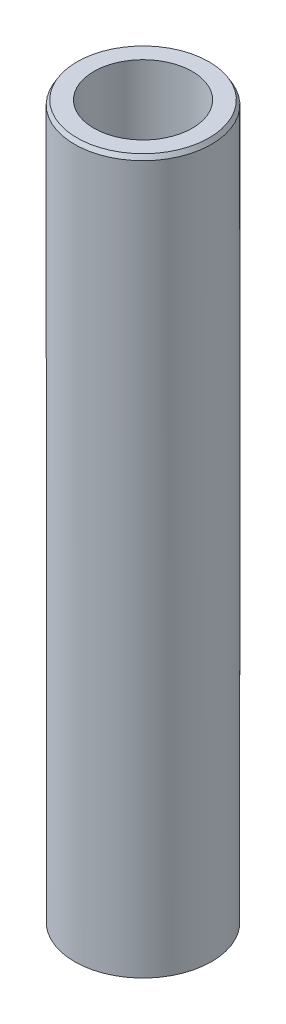
ISO-10303-21;
HEADER;
FILE_DESCRIPTION(('STEP AP214'),'2;1');
FILE_NAME('part.step','',(''),(''),'','','');
FILE_SCHEMA(('AUTOMOTIVE_DESIGN { 1 0 10303 214 1 1 1 1 }'));
ENDSEC;
DATA;
#1=APPLICATION_CONTEXT('core data for automotive mechanical design processes');
#2=APPLICATION_PROTOCOL_DEFINITION('international standard','automotive_design',2000,#1);
#3=PRODUCT_CONTEXT('',#1,'mechanical');
#4=PRODUCT('Part','Part','',(#3));
#5=PRODUCT_RELATED_PRODUCT_CATEGORY('part','',(#4));
#6=PRODUCT_DEFINITION_FORMATION('','',#4);
#7=PRODUCT_DEFINITION_CONTEXT('part definition',#1,'design');
#8=PRODUCT_DEFINITION('design','',#6,#7);
#9=PRODUCT_DEFINITION_SHAPE('','',#8);
#10=(LENGTH_UNIT() NAMED_UNIT(*) SI_UNIT(.MILLI.,.METRE.));
#11=(NAMED_UNIT(*) PLANE_ANGLE_UNIT() SI_UNIT($,.RADIAN.));
#12=(NAMED_UNIT(*) SI_UNIT($,.STERADIAN.) SOLID_ANGLE_UNIT());
#13=UNCERTAINTY_MEASURE_WITH_UNIT(LENGTH_MEASURE(1.E-05),#10,'distance_accuracy_value','');
#14=(GEOMETRIC_REPRESENTATION_CONTEXT(3) GLOBAL_UNCERTAINTY_ASSIGNED_CONTEXT((#13)) GLOBAL_UNIT_ASSIGNED_CONTEXT((#10,
#11,#12)) REPRESENTATION_CONTEXT('',''));
#15=CARTESIAN_POINT('',(0.,0.,0.));
#16=DIRECTION('',(0.,0.,1.));
#17=DIRECTION('',(1.,0.,0.));
#18=AXIS2_PLACEMENT_3D('',#15,#16,#17);
#19=CARTESIAN_POINT('',(0.,600.,0.));
#20=DIRECTION('',(0.,-1.,0.));
#21=DIRECTION('',(0.,0.,-1.));
#22=AXIS2_PLACEMENT_3D('',#19,#20,#21);
#23=CYLINDRICAL_SURFACE('',#22,57.5);
#24=CARTESIAN_POINT('',(0.,596.375143427795,0.));
#25=DIRECTION('',(0.,1.,0.));
#26=DIRECTION('',(0.,0.,1.));
#27=AXIS2_PLACEMENT_3D('',#24,#25,#26);
#28=CIRCLE('',#27,57.5);
#29=CARTESIAN_POINT('',(0.,596.375143427795,-57.5));
#30=VERTEX_POINT('',#29);
#31=EDGE_CURVE('E50',#30,#30,#28,.F.);
#32=ORIENTED_EDGE('',*,*,#31,.T.);
#33=EDGE_LOOP('',(#32));
#34=FACE_BOUND('',#33,.T.);
#35=CARTESIAN_POINT('',(0.,2.09281191773592,0.));
#36=DIRECTION('',(0.,1.,0.));
#37=DIRECTION('',(0.,0.,1.));
#38=AXIS2_PLACEMENT_3D('',#35,#36,#37);
#39=CIRCLE('',#38,57.5);
#40=CARTESIAN_POINT('',(0.,2.09281191773592,57.5));
#41=VERTEX_POINT('',#40);
#42=EDGE_CURVE('E51',#41,#41,#39,.T.);
#43=ORIENTED_EDGE('',*,*,#42,.T.);
#44=EDGE_LOOP('',(#43));
#45=FACE_BOUND('',#44,.T.);
#46=ADVANCED_FACE('F39',(#34,#45),#23,.T.);
#47=CARTESIAN_POINT('',(0.,600.,0.));
#48=DIRECTION('',(0.,1.,0.));
#49=DIRECTION('',(0.,0.,1.));
#50=AXIS2_PLACEMENT_3D('',#47,#48,#49);
#51=PLANE('',#50);
#52=CARTESIAN_POINT('',(0.,600.,0.));
#53=DIRECTION('',(0.,1.,0.));
#54=DIRECTION('',(0.,0.,1.));
#55=AXIS2_PLACEMENT_3D('',#52,#53,#54);
#56=CIRCLE('',#55,55.4071880822639);
#57=CARTESIAN_POINT('',(0.,600.,-55.4071880822639));
#58=VERTEX_POINT('',#57);
#59=EDGE_CURVE('E54',#58,#58,#56,.T.);
#60=ORIENTED_EDGE('',*,*,#59,.T.);
#61=EDGE_LOOP('',(#60));
#62=FACE_BOUND('',#61,.T.);
#63=CARTESIAN_POINT('',(0.,600.,0.));
#64=DIRECTION('',(0.,1.,0.));
#65=DIRECTION('',(0.,0.,1.));
#66=AXIS2_PLACEMENT_3D('',#63,#64,#65);
#67=CIRCLE('',#66,41.3142358974336);
#68=CARTESIAN_POINT('',(0.,600.,41.3142358974336));
#69=VERTEX_POINT('',#68);
#70=EDGE_CURVE('E58',#69,#69,#67,.T.);
#71=ORIENTED_EDGE('',*,*,#70,.F.);
#72=EDGE_LOOP('',(#71));
#73=FACE_BOUND('',#72,.T.);
#74=ADVANCED_FACE('F69',(#62,#73),#51,.T.);
#75=CARTESIAN_POINT('',(0.,0.,0.));
#76=DIRECTION('',(0.,1.,0.));
#77=DIRECTION('',(0.,0.,1.));
#78=AXIS2_PLACEMENT_3D('',#75,#76,#77);
#79=PLANE('',#78);
#80=CARTESIAN_POINT('',(0.,0.,0.));
#81=DIRECTION('',(0.,1.,0.));
#82=DIRECTION('',(0.,0.,1.));
#83=AXIS2_PLACEMENT_3D('',#80,#81,#82);
#84=CIRCLE('',#83,53.8751434277957);
#85=CARTESIAN_POINT('',(0.,0.,53.8751434277957));
#86=VERTEX_POINT('',#85);
#87=EDGE_CURVE('E10',#86,#86,#84,.F.);
#88=ORIENTED_EDGE('',*,*,#87,.T.);
#89=EDGE_LOOP('',(#88));
#90=FACE_BOUND('',#89,.T.);
#91=CARTESIAN_POINT('',(0.,0.,0.));
#92=DIRECTION('',(0.,1.,0.));
#93=DIRECTION('',(0.,0.,1.));
#94=AXIS2_PLACEMENT_3D('',#91,#92,#93);
#95=CIRCLE('',#94,41.3142358974336);
#96=CARTESIAN_POINT('',(0.,0.,41.3142358974336));
#97=VERTEX_POINT('',#96);
#98=EDGE_CURVE('E63',#97,#97,#95,.T.);
#99=ORIENTED_EDGE('',*,*,#98,.T.);
#100=EDGE_LOOP('',(#99));
#101=FACE_BOUND('',#100,.T.);
#102=ADVANCED_FACE('F75',(#90,#101),#79,.F.);
#103=CARTESIAN_POINT('',(0.,600.,0.));
#104=DIRECTION('',(0.,-1.,0.));
#105=DIRECTION('',(0.,0.,-1.));
#106=AXIS2_PLACEMENT_3D('',#103,#104,#105);
#107=CYLINDRICAL_SURFACE('',#106,41.3142358974336);
#108=ORIENTED_EDGE('',*,*,#70,.T.);
#109=EDGE_LOOP('',(#108));
#110=FACE_BOUND('',#109,.T.);
#111=ORIENTED_EDGE('',*,*,#98,.F.);
#112=EDGE_LOOP('',(#111));
#113=FACE_BOUND('',#112,.T.);
#114=ADVANCED_FACE('F70',(#110,#113),#107,.F.);
#115=CARTESIAN_POINT('',(0.,600.,0.));
#116=DIRECTION('',(0.,-1.,0.));
#117=DIRECTION('',(0.,0.,-1.));
#118=AXIS2_PLACEMENT_3D('',#115,#116,#117);
#119=CONICAL_SURFACE('',#118,55.4071880822639,0.523598775598296);
#120=CARTESIAN_POINT('',(0.,596.375143427795,-57.5));
#121=CARTESIAN_POINT('',(0.,596.412902350422,-57.478199875857));
#122=CARTESIAN_POINT('',(0.,596.450661273049,-57.4563997517139));
#123=CARTESIAN_POINT('',(0.,596.526179118304,-57.4127995034277));
#124=CARTESIAN_POINT('',(0.,596.563938040931,-57.3909993792846));
#125=CARTESIAN_POINT('',(0.,596.639455886185,-57.3473991309984));
#126=CARTESIAN_POINT('',(0.,596.677214808812,-57.3255990068554));
#127=CARTESIAN_POINT('',(0.,596.752732654067,-57.2819987585692));
#128=CARTESIAN_POINT('',(0.,596.790491576694,-57.2601986344261));
#129=CARTESIAN_POINT('',(0.,596.866009421948,-57.2165983861399));
#130=CARTESIAN_POINT('',(0.,596.903768344575,-57.1947982619968));
#131=CARTESIAN_POINT('',(0.,596.979286189829,-57.1511980137107));
#132=CARTESIAN_POINT('',(0.,597.017045112456,-57.1293978895676));
#133=CARTESIAN_POINT('',(0.,597.092562957711,-57.0857976412814));
#134=CARTESIAN_POINT('',(0.,597.130321880338,-57.0639975171383));
#135=CARTESIAN_POINT('',(0.,597.205839725592,-57.0203972688522));
#136=CARTESIAN_POINT('',(0.,597.243598648219,-56.9985971447091));
#137=CARTESIAN_POINT('',(0.,597.319116493474,-56.9549968964229));
#138=CARTESIAN_POINT('',(0.,597.356875416101,-56.9331967722798));
#139=CARTESIAN_POINT('',(0.,597.432393261355,-56.8895965239937));
#140=CARTESIAN_POINT('',(0.,597.470152183982,-56.8677963998506));
#141=CARTESIAN_POINT('',(0.,597.545670029236,-56.8241961515644));
#142=CARTESIAN_POINT('',(0.,597.583428951863,-56.8023960274213));
#143=CARTESIAN_POINT('',(0.,597.658946797118,-56.7587957791352));
#144=CARTESIAN_POINT('',(0.,597.696705719745,-56.7369956549921));
#145=CARTESIAN_POINT('',(0.,597.772223564999,-56.6933954067059));
#146=CARTESIAN_POINT('',(0.,597.809982487626,-56.6715952825628));
#147=CARTESIAN_POINT('',(0.,597.885500332881,-56.6279950342766));
#148=CARTESIAN_POINT('',(0.,597.923259255508,-56.6061949101336));
#149=CARTESIAN_POINT('',(0.,597.998777100762,-56.5625946618474));
#150=CARTESIAN_POINT('',(0.,598.036536023389,-56.5407945377043));
#151=CARTESIAN_POINT('',(0.,598.112053868643,-56.4971942894181));
#152=CARTESIAN_POINT('',(0.,598.14981279127,-56.475394165275));
#153=CARTESIAN_POINT('',(0.,598.225330636525,-56.4317939169889));
#154=CARTESIAN_POINT('',(0.,598.263089559152,-56.4099937928458));
#155=CARTESIAN_POINT('',(0.,598.338607404406,-56.3663935445596));
#156=CARTESIAN_POINT('',(0.,598.376366327033,-56.3445934204165));
#157=CARTESIAN_POINT('',(0.,598.451884172288,-56.3009931721304));
#158=CARTESIAN_POINT('',(0.,598.489643094915,-56.2791930479873));
#159=CARTESIAN_POINT('',(0.,598.565160940169,-56.2355927997011));
#160=CARTESIAN_POINT('',(0.,598.602919862796,-56.213792675558));
#161=CARTESIAN_POINT('',(0.,598.67843770805,-56.1701924272719));
#162=CARTESIAN_POINT('',(0.,598.716196630677,-56.1483923031288));
#163=CARTESIAN_POINT('',(0.,598.791714475932,-56.1047920548426));
#164=CARTESIAN_POINT('',(0.,598.829473398559,-56.0829919306995));
#165=CARTESIAN_POINT('',(0.,598.904991243813,-56.0393916824134));
#166=CARTESIAN_POINT('',(0.,598.94275016644,-56.0175915582703));
#167=CARTESIAN_POINT('',(0.,599.018268011694,-55.9739913099841));
#168=CARTESIAN_POINT('',(0.,599.056026934322,-55.952191185841));
#169=CARTESIAN_POINT('',(0.,599.131544779576,-55.9085909375548));
#170=CARTESIAN_POINT('',(0.,599.169303702203,-55.8867908134118));
#171=CARTESIAN_POINT('',(0.,599.244821547457,-55.8431905651256));
#172=CARTESIAN_POINT('',(0.,599.282580470084,-55.8213904409825));
#173=CARTESIAN_POINT('',(0.,599.358098315339,-55.7777901926963));
#174=CARTESIAN_POINT('',(0.,599.395857237966,-55.7559900685533));
#175=CARTESIAN_POINT('',(0.,599.47137508322,-55.7123898202671));
#176=CARTESIAN_POINT('',(0.,599.509134005847,-55.690589696124));
#177=CARTESIAN_POINT('',(0.,599.584651851101,-55.6469894478378));
#178=CARTESIAN_POINT('',(0.,599.622410773729,-55.6251893236947));
#179=CARTESIAN_POINT('',(0.,599.697928618983,-55.5815890754086));
#180=CARTESIAN_POINT('',(0.,599.73568754161,-55.5597889512655));
#181=CARTESIAN_POINT('',(0.,599.811205386864,-55.5161887029793));
#182=CARTESIAN_POINT('',(0.,599.848964309491,-55.4943885788362));
#183=CARTESIAN_POINT('',(0.,599.924482154746,-55.4507883305501));
#184=CARTESIAN_POINT('',(0.,599.962241077373,-55.428988206407));
#185=CARTESIAN_POINT('',(0.,600.,-55.4071880822639));
#186=B_SPLINE_CURVE_WITH_KNOTS('',3,(#120,#121,#122,#123,#124,#125,#126,#127,#128,#129,#130,
#131,#132,#133,#134,#135,#136,#137,#138,#139,#140,#141,#142,#143,#144,#145,#146,#147,#148,#149,
#150,#151,#152,#153,#154,#155,#156,#157,#158,#159,#160,#161,#162,#163,#164,#165,#166,#167,#168,
#169,#170,#171,#172,#173,#174,#175,#176,#177,#178,#179,#180,#181,#182,#183,#184,#185),
.UNSPECIFIED.,.F.,.F.,(4,2,2,2,2,2,2,2,2,2,2,2,2,2,2,2,2,2,2,2,2,2,2,2,2,2,2,2,2,2,2,2,4),(0.,
0.130800744858531,0.261601489717061,0.392402234575592,0.523202979434122,0.654003724292557,
0.784804469151087,0.915605214009621,1.04640595886815,1.17720670372668,1.30800744858512,
1.43880819344365,1.56960893830218,1.70040968316071,1.83121042801914,1.96201117287767,
2.0928119177362,2.22361266259473,2.35441340745326,2.4852141523117,2.61601489717023,
2.74681564202876,2.87761638688729,3.00841713174573,3.13921787660426,3.27001862146279,
3.40081936632132,3.53162011117985,3.66242085603828,3.79322160089681,3.92402234575534,
4.05482309061387,4.1856238354724),.UNSPECIFIED.);
#187=EDGE_CURVE('BSEAM81',#30,#58,#186,.T.);
#188=ORIENTED_EDGE('',*,*,#31,.F.);
#189=ORIENTED_EDGE('',*,*,#59,.F.);
#190=ORIENTED_EDGE('',*,*,#187,.T.);
#191=ORIENTED_EDGE('',*,*,#187,.F.);
#192=EDGE_LOOP('',(#188,#190,#189,#191));
#193=FACE_BOUND('',#192,.T.);
#194=ADVANCED_FACE('F81',(#193),#119,.T.);
#195=CARTESIAN_POINT('',(0.,2.09281191773592,0.));
#196=DIRECTION('',(0.,1.,0.));
#197=DIRECTION('',(0.,0.,1.));
#198=AXIS2_PLACEMENT_3D('',#195,#196,#197);
#199=CONICAL_SURFACE('',#198,57.5,1.0471975511966);
#200=ORIENTED_EDGE('',*,*,#87,.F.);
#201=EDGE_LOOP('',(#200));
#202=FACE_BOUND('',#201,.T.);
#203=ORIENTED_EDGE('',*,*,#42,.F.);
#204=EDGE_LOOP('',(#203));
#205=FACE_BOUND('',#204,.T.);
#206=ADVANCED_FACE('F45',(#202,#205),#199,.T.);
#207=CLOSED_SHELL('',(#46,#74,#102,#114,#194,#206));
#208=MANIFOLD_SOLID_BREP('B2',#207);
#209=ADVANCED_BREP_SHAPE_REPRESENTATION('',(#18,#208),#14);
#210=SHAPE_DEFINITION_REPRESENTATION(#9,#209);
ENDSEC;
END-ISO-10303-21;
